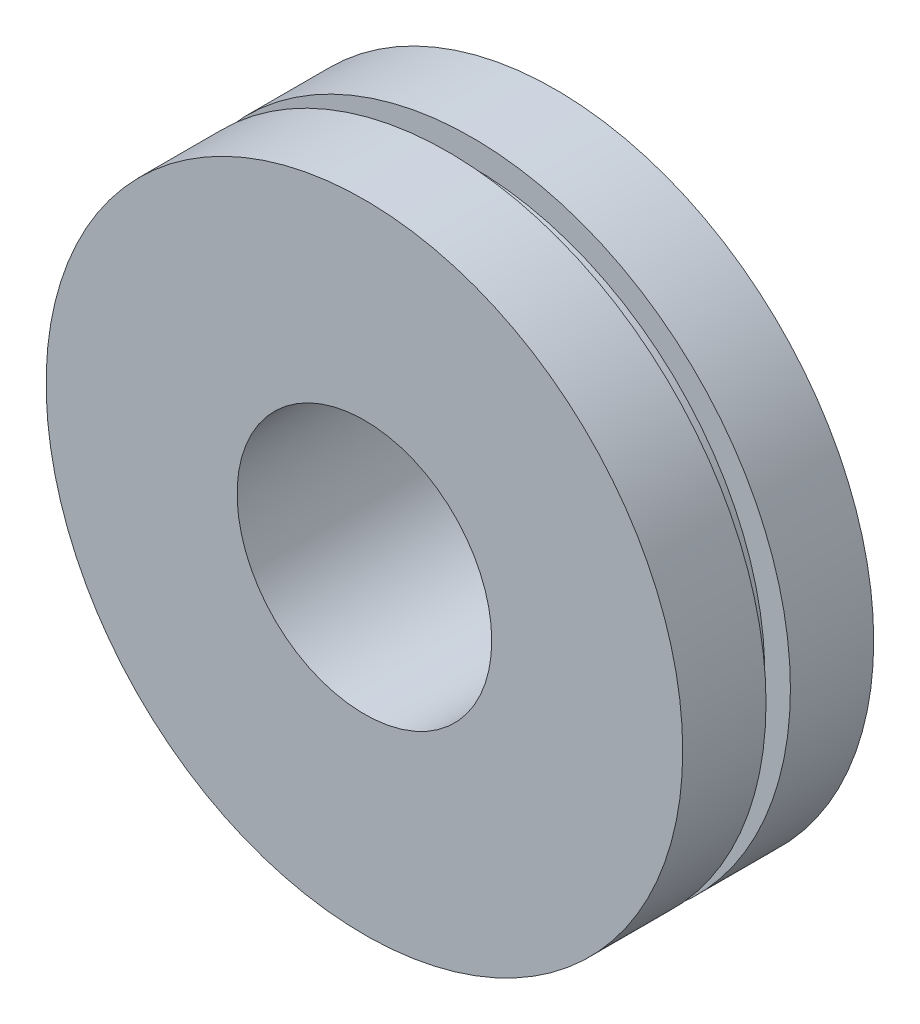
ISO-10303-21;
HEADER;
FILE_DESCRIPTION(('STEP AP214'),'2;1');
FILE_NAME('part.step','',(''),(''),'','','');
FILE_SCHEMA(('AUTOMOTIVE_DESIGN { 1 0 10303 214 1 1 1 1 }'));
ENDSEC;
DATA;
#1=APPLICATION_CONTEXT('core data for automotive mechanical design processes');
#2=APPLICATION_PROTOCOL_DEFINITION('international standard','automotive_design',2000,#1);
#3=PRODUCT_CONTEXT('',#1,'mechanical');
#4=PRODUCT('Part','Part','',(#3));
#5=PRODUCT_RELATED_PRODUCT_CATEGORY('part','',(#4));
#6=PRODUCT_DEFINITION_FORMATION('','',#4);
#7=PRODUCT_DEFINITION_CONTEXT('part definition',#1,'design');
#8=PRODUCT_DEFINITION('design','',#6,#7);
#9=PRODUCT_DEFINITION_SHAPE('','',#8);
#10=(LENGTH_UNIT() NAMED_UNIT(*) SI_UNIT(.MILLI.,.METRE.));
#11=(NAMED_UNIT(*) PLANE_ANGLE_UNIT() SI_UNIT($,.RADIAN.));
#12=(NAMED_UNIT(*) SI_UNIT($,.STERADIAN.) SOLID_ANGLE_UNIT());
#13=UNCERTAINTY_MEASURE_WITH_UNIT(LENGTH_MEASURE(1.E-05),#10,'distance_accuracy_value','');
#14=(GEOMETRIC_REPRESENTATION_CONTEXT(3) GLOBAL_UNCERTAINTY_ASSIGNED_CONTEXT((#13)) GLOBAL_UNIT_ASSIGNED_CONTEXT((#10,
#11,#12)) REPRESENTATION_CONTEXT('',''));
#15=CARTESIAN_POINT('',(0.,0.,0.));
#16=DIRECTION('',(0.,0.,1.));
#17=DIRECTION('',(1.,0.,0.));
#18=AXIS2_PLACEMENT_3D('',#15,#16,#17);
#19=CARTESIAN_POINT('',(0.,0.,7.83));
#20=DIRECTION('',(0.,0.,-1.));
#21=DIRECTION('',(-1.,0.,0.));
#22=AXIS2_PLACEMENT_3D('',#19,#20,#21);
#23=CYLINDRICAL_SURFACE('',#22,13.05);
#24=CARTESIAN_POINT('',(0.,0.,7.83));
#25=DIRECTION('',(0.,0.,1.));
#26=DIRECTION('',(1.,0.,0.));
#27=AXIS2_PLACEMENT_3D('',#24,#25,#26);
#28=CIRCLE('',#27,13.05);
#29=CARTESIAN_POINT('',(13.05,0.,7.83));
#30=VERTEX_POINT('',#29);
#31=EDGE_CURVE('E11',#30,#30,#28,.T.);
#32=ORIENTED_EDGE('',*,*,#31,.F.);
#33=EDGE_LOOP('',(#32));
#34=FACE_BOUND('',#33,.T.);
#35=CARTESIAN_POINT('',(0.,0.,4.415));
#36=DIRECTION('',(0.,0.,1.));
#37=DIRECTION('',(1.,0.,0.));
#38=AXIS2_PLACEMENT_3D('',#35,#36,#37);
#39=CIRCLE('',#38,13.05);
#40=CARTESIAN_POINT('',(13.05,0.,4.415));
#41=VERTEX_POINT('',#40);
#42=EDGE_CURVE('E59',#41,#41,#39,.T.);
#43=ORIENTED_EDGE('',*,*,#42,.T.);
#44=EDGE_LOOP('',(#43));
#45=FACE_BOUND('',#44,.T.);
#46=ADVANCED_FACE('F38',(#34,#45),#23,.T.);
#47=CARTESIAN_POINT('',(0.,0.,7.83));
#48=DIRECTION('',(0.,0.,1.));
#49=DIRECTION('',(1.,0.,0.));
#50=AXIS2_PLACEMENT_3D('',#47,#48,#49);
#51=PLANE('',#50);
#52=ORIENTED_EDGE('',*,*,#31,.T.);
#53=EDGE_LOOP('',(#52));
#54=FACE_BOUND('',#53,.T.);
#55=CARTESIAN_POINT('',(0.,0.,7.83));
#56=DIRECTION('',(0.,0.,1.));
#57=DIRECTION('',(1.,0.,0.));
#58=AXIS2_PLACEMENT_3D('',#55,#56,#57);
#59=CIRCLE('',#58,5.22);
#60=CARTESIAN_POINT('',(5.22,0.,7.83));
#61=VERTEX_POINT('',#60);
#62=EDGE_CURVE('E49',#61,#61,#59,.T.);
#63=ORIENTED_EDGE('',*,*,#62,.F.);
#64=EDGE_LOOP('',(#63));
#65=FACE_BOUND('',#64,.T.);
#66=ADVANCED_FACE('F88',(#54,#65),#51,.T.);
#67=CARTESIAN_POINT('',(0.,0.,0.));
#68=DIRECTION('',(0.,0.,1.));
#69=DIRECTION('',(1.,0.,0.));
#70=AXIS2_PLACEMENT_3D('',#67,#68,#69);
#71=PLANE('',#70);
#72=CARTESIAN_POINT('',(0.,0.,0.));
#73=DIRECTION('',(0.,0.,1.));
#74=DIRECTION('',(1.,0.,0.));
#75=AXIS2_PLACEMENT_3D('',#72,#73,#74);
#76=CIRCLE('',#75,13.05);
#77=CARTESIAN_POINT('',(13.05,0.,0.));
#78=VERTEX_POINT('',#77);
#79=EDGE_CURVE('E42',#78,#78,#76,.T.);
#80=ORIENTED_EDGE('',*,*,#79,.F.);
#81=EDGE_LOOP('',(#80));
#82=FACE_BOUND('',#81,.T.);
#83=CARTESIAN_POINT('',(0.,0.,0.));
#84=DIRECTION('',(0.,0.,1.));
#85=DIRECTION('',(1.,0.,0.));
#86=AXIS2_PLACEMENT_3D('',#83,#84,#85);
#87=CIRCLE('',#86,5.22);
#88=CARTESIAN_POINT('',(5.22,0.,0.));
#89=VERTEX_POINT('',#88);
#90=EDGE_CURVE('E51',#89,#89,#87,.T.);
#91=ORIENTED_EDGE('',*,*,#90,.T.);
#92=EDGE_LOOP('',(#91));
#93=FACE_BOUND('',#92,.T.);
#94=ADVANCED_FACE('F93',(#82,#93),#71,.F.);
#95=CARTESIAN_POINT('',(0.,0.,3.415));
#96=DIRECTION('',(0.,0.,1.));
#97=DIRECTION('',(1.,0.,0.));
#98=AXIS2_PLACEMENT_3D('',#95,#96,#97);
#99=CIRCLE('',#98,13.05);
#100=CARTESIAN_POINT('',(13.05,0.,3.415));
#101=VERTEX_POINT('',#100);
#102=EDGE_CURVE('E54',#101,#101,#99,.T.);
#103=ORIENTED_EDGE('',*,*,#102,.F.);
#104=EDGE_LOOP('',(#103));
#105=FACE_BOUND('',#104,.T.);
#106=ORIENTED_EDGE('',*,*,#79,.T.);
#107=EDGE_LOOP('',(#106));
#108=FACE_BOUND('',#107,.T.);
#109=ADVANCED_FACE('F40',(#105,#108),#23,.T.);
#110=CARTESIAN_POINT('',(0.,0.,7.83));
#111=DIRECTION('',(0.,0.,-1.));
#112=DIRECTION('',(-1.,0.,0.));
#113=AXIS2_PLACEMENT_3D('',#110,#111,#112);
#114=CYLINDRICAL_SURFACE('',#113,5.22);
#115=ORIENTED_EDGE('',*,*,#62,.T.);
#116=EDGE_LOOP('',(#115));
#117=FACE_BOUND('',#116,.T.);
#118=ORIENTED_EDGE('',*,*,#90,.F.);
#119=EDGE_LOOP('',(#118));
#120=FACE_BOUND('',#119,.T.);
#121=ADVANCED_FACE('F84',(#117,#120),#114,.F.);
#122=CARTESIAN_POINT('',(0.,0.,4.41499999999999));
#123=DIRECTION('',(0.,0.,-1.));
#124=DIRECTION('',(-1.,0.,0.));
#125=AXIS2_PLACEMENT_3D('',#122,#123,#124);
#126=PLANE('',#125);
#127=ORIENTED_EDGE('',*,*,#42,.F.);
#128=EDGE_LOOP('',(#127));
#129=FACE_BOUND('',#128,.T.);
#130=CARTESIAN_POINT('',(0.,0.,4.415));
#131=DIRECTION('',(0.,0.,1.));
#132=DIRECTION('',(1.,0.,0.));
#133=AXIS2_PLACEMENT_3D('',#130,#131,#132);
#134=CIRCLE('',#133,12.);
#135=CARTESIAN_POINT('',(-12.,0.,4.415));
#136=VERTEX_POINT('',#135);
#137=EDGE_CURVE('E65',#136,#136,#134,.T.);
#138=ORIENTED_EDGE('',*,*,#137,.T.);
#139=EDGE_LOOP('',(#138));
#140=FACE_BOUND('',#139,.T.);
#141=ADVANCED_FACE('F69',(#129,#140),#126,.T.);
#142=CARTESIAN_POINT('',(0.,0.,3.41499999999999));
#143=DIRECTION('',(0.,0.,-1.));
#144=DIRECTION('',(-1.,0.,0.));
#145=AXIS2_PLACEMENT_3D('',#142,#143,#144);
#146=PLANE('',#145);
#147=ORIENTED_EDGE('',*,*,#102,.T.);
#148=EDGE_LOOP('',(#147));
#149=FACE_BOUND('',#148,.T.);
#150=CARTESIAN_POINT('',(0.,0.,3.415));
#151=DIRECTION('',(0.,0.,1.));
#152=DIRECTION('',(1.,0.,0.));
#153=AXIS2_PLACEMENT_3D('',#150,#151,#152);
#154=CIRCLE('',#153,12.);
#155=CARTESIAN_POINT('',(-12.,0.,3.415));
#156=VERTEX_POINT('',#155);
#157=EDGE_CURVE('E62',#156,#156,#154,.T.);
#158=ORIENTED_EDGE('',*,*,#157,.F.);
#159=EDGE_LOOP('',(#158));
#160=FACE_BOUND('',#159,.T.);
#161=ADVANCED_FACE('F74',(#149,#160),#146,.F.);
#162=CARTESIAN_POINT('',(0.,0.,4.415));
#163=DIRECTION('',(0.,0.,-1.));
#164=DIRECTION('',(-1.,0.,0.));
#165=AXIS2_PLACEMENT_3D('',#162,#163,#164);
#166=CYLINDRICAL_SURFACE('',#165,12.);
#167=CARTESIAN_POINT('',(-12.,0.,4.415));
#168=CARTESIAN_POINT('',(-12.,0.,4.40458333333333));
#169=CARTESIAN_POINT('',(-12.,0.,4.39416666666667));
#170=CARTESIAN_POINT('',(-12.,0.,4.37333333333333));
#171=CARTESIAN_POINT('',(-12.,0.,4.36291666666667));
#172=CARTESIAN_POINT('',(-12.,0.,4.34208333333333));
#173=CARTESIAN_POINT('',(-12.,0.,4.33166666666667));
#174=CARTESIAN_POINT('',(-12.,0.,4.31083333333333));
#175=CARTESIAN_POINT('',(-12.,0.,4.30041666666667));
#176=CARTESIAN_POINT('',(-12.,0.,4.27958333333333));
#177=CARTESIAN_POINT('',(-12.,0.,4.26916666666667));
#178=CARTESIAN_POINT('',(-12.,0.,4.24833333333333));
#179=CARTESIAN_POINT('',(-12.,0.,4.23791666666667));
#180=CARTESIAN_POINT('',(-12.,0.,4.21708333333333));
#181=CARTESIAN_POINT('',(-12.,0.,4.20666666666667));
#182=CARTESIAN_POINT('',(-12.,0.,4.18583333333333));
#183=CARTESIAN_POINT('',(-12.,0.,4.17541666666667));
#184=CARTESIAN_POINT('',(-12.,0.,4.15458333333333));
#185=CARTESIAN_POINT('',(-12.,0.,4.14416666666667));
#186=CARTESIAN_POINT('',(-12.,0.,4.12333333333333));
#187=CARTESIAN_POINT('',(-12.,0.,4.11291666666667));
#188=CARTESIAN_POINT('',(-12.,0.,4.09208333333333));
#189=CARTESIAN_POINT('',(-12.,0.,4.08166666666667));
#190=CARTESIAN_POINT('',(-12.,0.,4.06083333333333));
#191=CARTESIAN_POINT('',(-12.,0.,4.05041666666667));
#192=CARTESIAN_POINT('',(-12.,0.,4.02958333333333));
#193=CARTESIAN_POINT('',(-12.,0.,4.01916666666667));
#194=CARTESIAN_POINT('',(-12.,0.,3.99833333333333));
#195=CARTESIAN_POINT('',(-12.,0.,3.98791666666667));
#196=CARTESIAN_POINT('',(-12.,0.,3.96708333333333));
#197=CARTESIAN_POINT('',(-12.,0.,3.95666666666667));
#198=CARTESIAN_POINT('',(-12.,0.,3.93583333333333));
#199=CARTESIAN_POINT('',(-12.,0.,3.92541666666667));
#200=CARTESIAN_POINT('',(-12.,0.,3.90458333333333));
#201=CARTESIAN_POINT('',(-12.,0.,3.89416666666667));
#202=CARTESIAN_POINT('',(-12.,0.,3.87333333333333));
#203=CARTESIAN_POINT('',(-12.,0.,3.86291666666667));
#204=CARTESIAN_POINT('',(-12.,0.,3.84208333333333));
#205=CARTESIAN_POINT('',(-12.,0.,3.83166666666667));
#206=CARTESIAN_POINT('',(-12.,0.,3.81083333333333));
#207=CARTESIAN_POINT('',(-12.,0.,3.80041666666667));
#208=CARTESIAN_POINT('',(-12.,0.,3.77958333333333));
#209=CARTESIAN_POINT('',(-12.,0.,3.76916666666667));
#210=CARTESIAN_POINT('',(-12.,0.,3.74833333333333));
#211=CARTESIAN_POINT('',(-12.,0.,3.73791666666667));
#212=CARTESIAN_POINT('',(-12.,0.,3.71708333333333));
#213=CARTESIAN_POINT('',(-12.,0.,3.70666666666667));
#214=CARTESIAN_POINT('',(-12.,0.,3.68583333333333));
#215=CARTESIAN_POINT('',(-12.,0.,3.67541666666667));
#216=CARTESIAN_POINT('',(-12.,0.,3.65458333333333));
#217=CARTESIAN_POINT('',(-12.,0.,3.64416666666667));
#218=CARTESIAN_POINT('',(-12.,0.,3.62333333333333));
#219=CARTESIAN_POINT('',(-12.,0.,3.61291666666667));
#220=CARTESIAN_POINT('',(-12.,0.,3.59208333333333));
#221=CARTESIAN_POINT('',(-12.,0.,3.58166666666667));
#222=CARTESIAN_POINT('',(-12.,0.,3.56083333333333));
#223=CARTESIAN_POINT('',(-12.,0.,3.55041666666667));
#224=CARTESIAN_POINT('',(-12.,0.,3.52958333333333));
#225=CARTESIAN_POINT('',(-12.,0.,3.51916666666667));
#226=CARTESIAN_POINT('',(-12.,0.,3.49833333333333));
#227=CARTESIAN_POINT('',(-12.,0.,3.48791666666667));
#228=CARTESIAN_POINT('',(-12.,0.,3.46708333333333));
#229=CARTESIAN_POINT('',(-12.,0.,3.45666666666667));
#230=CARTESIAN_POINT('',(-12.,0.,3.43583333333333));
#231=CARTESIAN_POINT('',(-12.,0.,3.42541666666667));
#232=CARTESIAN_POINT('',(-12.,0.,3.415));
#233=B_SPLINE_CURVE_WITH_KNOTS('',3,(#167,#168,#169,#170,#171,#172,#173,#174,#175,#176,#177,
#178,#179,#180,#181,#182,#183,#184,#185,#186,#187,#188,#189,#190,#191,#192,#193,#194,#195,#196,
#197,#198,#199,#200,#201,#202,#203,#204,#205,#206,#207,#208,#209,#210,#211,#212,#213,#214,#215,
#216,#217,#218,#219,#220,#221,#222,#223,#224,#225,#226,#227,#228,#229,#230,#231,#232),
.UNSPECIFIED.,.F.,.F.,(4,2,2,2,2,2,2,2,2,2,2,2,2,2,2,2,2,2,2,2,2,2,2,2,2,2,2,2,2,2,2,2,4),(0.,
0.03125,0.0625000000000001,0.0937500000000001,0.125,0.15625,0.1875,0.21875,0.25,0.28125,0.3125,
0.34375,0.375,0.40625,0.4375,0.46875,0.5,0.53125,0.5625,0.593750000000001,0.625000000000001,
0.656250000000001,0.687500000000001,0.718750000000001,0.750000000000001,0.781250000000001,
0.812500000000001,0.84375,0.875,0.90625,0.9375,0.96875,1.),.UNSPECIFIED.);
#234=EDGE_CURVE('BSEAM71',#136,#156,#233,.T.);
#235=ORIENTED_EDGE('',*,*,#137,.F.);
#236=ORIENTED_EDGE('',*,*,#157,.T.);
#237=ORIENTED_EDGE('',*,*,#234,.T.);
#238=ORIENTED_EDGE('',*,*,#234,.F.);
#239=EDGE_LOOP('',(#235,#237,#236,#238));
#240=FACE_BOUND('',#239,.T.);
#241=ADVANCED_FACE('F71',(#240),#166,.T.);
#242=CLOSED_SHELL('',(#46,#66,#94,#109,#121,#141,#161,#241));
#243=MANIFOLD_SOLID_BREP('B2',#242);
#244=ADVANCED_BREP_SHAPE_REPRESENTATION('',(#18,#243),#14);
#245=SHAPE_DEFINITION_REPRESENTATION(#9,#244);
ENDSEC;
END-ISO-10303-21;
